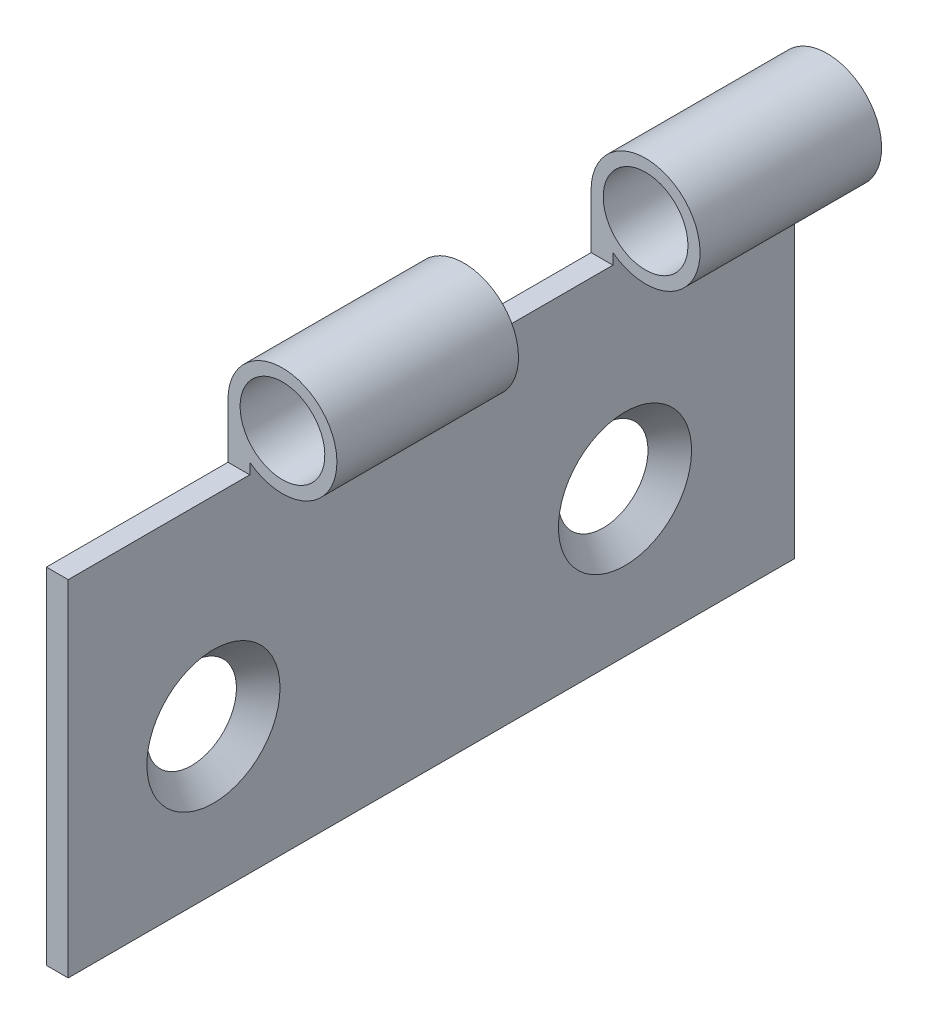
ISO-10303-21;
HEADER;
FILE_DESCRIPTION(('STEP AP214'),'2;1');
FILE_NAME('part.step','',(''),(''),'','','');
FILE_SCHEMA(('AUTOMOTIVE_DESIGN { 1 0 10303 214 1 1 1 1 }'));
ENDSEC;
DATA;
#1=APPLICATION_CONTEXT('core data for automotive mechanical design processes');
#2=APPLICATION_PROTOCOL_DEFINITION('international standard','automotive_design',2000,#1);
#3=PRODUCT_CONTEXT('',#1,'mechanical');
#4=PRODUCT('Part','Part','',(#3));
#5=PRODUCT_RELATED_PRODUCT_CATEGORY('part','',(#4));
#6=PRODUCT_DEFINITION_FORMATION('','',#4);
#7=PRODUCT_DEFINITION_CONTEXT('part definition',#1,'design');
#8=PRODUCT_DEFINITION('design','',#6,#7);
#9=PRODUCT_DEFINITION_SHAPE('','',#8);
#10=(LENGTH_UNIT() NAMED_UNIT(*) SI_UNIT(.MILLI.,.METRE.));
#11=(NAMED_UNIT(*) PLANE_ANGLE_UNIT() SI_UNIT($,.RADIAN.));
#12=(NAMED_UNIT(*) SI_UNIT($,.STERADIAN.) SOLID_ANGLE_UNIT());
#13=UNCERTAINTY_MEASURE_WITH_UNIT(LENGTH_MEASURE(1.E-05),#10,'distance_accuracy_value','');
#14=(GEOMETRIC_REPRESENTATION_CONTEXT(3) GLOBAL_UNCERTAINTY_ASSIGNED_CONTEXT((#13)) GLOBAL_UNIT_ASSIGNED_CONTEXT((#10,
#11,#12)) REPRESENTATION_CONTEXT('',''));
#15=CARTESIAN_POINT('',(0.,0.,0.));
#16=DIRECTION('',(0.,0.,1.));
#17=DIRECTION('',(1.,0.,0.));
#18=AXIS2_PLACEMENT_3D('',#15,#16,#17);
#19=CARTESIAN_POINT('',(0.,0.,15.));
#20=DIRECTION('',(-1.,0.,0.));
#21=DIRECTION('',(0.,0.,1.));
#22=AXIS2_PLACEMENT_3D('',#19,#20,#21);
#23=PLANE('',#22);
#24=CARTESIAN_POINT('',(0.,6.,9.));
#25=DIRECTION('',(-1.,0.,0.));
#26=DIRECTION('',(0.,0.,1.));
#27=AXIS2_PLACEMENT_3D('',#24,#25,#26);
#28=CIRCLE('',#27,1.85);
#29=CARTESIAN_POINT('',(0.,6.,10.85));
#30=VERTEX_POINT('',#29);
#31=EDGE_CURVE('E272',#30,#30,#28,.T.);
#32=ORIENTED_EDGE('',*,*,#31,.F.);
#33=EDGE_LOOP('',(#32));
#34=FACE_BOUND('',#33,.T.);
#35=CARTESIAN_POINT('',(0.,6.,-8.));
#36=DIRECTION('',(-1.,0.,0.));
#37=DIRECTION('',(0.,0.,1.));
#38=AXIS2_PLACEMENT_3D('',#35,#36,#37);
#39=CIRCLE('',#38,1.85);
#40=CARTESIAN_POINT('',(0.,6.,-6.15));
#41=VERTEX_POINT('',#40);
#42=EDGE_CURVE('E44',#41,#41,#39,.T.);
#43=ORIENTED_EDGE('',*,*,#42,.F.);
#44=EDGE_LOOP('',(#43));
#45=FACE_BOUND('',#44,.T.);
#46=DIRECTION('',(0.,1.,0.));
#47=VECTOR('',#46,1.);
#48=CARTESIAN_POINT('',(0.,18.75,0.));
#49=LINE('',#48,#47);
#50=CARTESIAN_POINT('',(0.,14.25,0.));
#51=VERTEX_POINT('',#50);
#52=CARTESIAN_POINT('',(0.,16.5,0.));
#53=VERTEX_POINT('',#52);
#54=EDGE_CURVE('E252',#51,#53,#49,.T.);
#55=ORIENTED_EDGE('',*,*,#54,.F.);
#56=DIRECTION('',(0.,0.,1.));
#57=VECTOR('',#56,1.);
#58=CARTESIAN_POINT('',(0.,14.25,0.));
#59=LINE('',#58,#57);
#60=CARTESIAN_POINT('',(0.,14.25,-7.5));
#61=VERTEX_POINT('',#60);
#62=EDGE_CURVE('E265',#61,#51,#59,.T.);
#63=ORIENTED_EDGE('',*,*,#62,.F.);
#64=DIRECTION('',(0.,-1.,0.));
#65=VECTOR('',#64,1.);
#66=CARTESIAN_POINT('',(0.,18.75,-7.5));
#67=LINE('',#66,#65);
#68=CARTESIAN_POINT('',(0.,16.5,-7.5));
#69=VERTEX_POINT('',#68);
#70=EDGE_CURVE('E262',#69,#61,#67,.T.);
#71=ORIENTED_EDGE('',*,*,#70,.F.);
#72=DIRECTION('',(0.,0.,-1.));
#73=VECTOR('',#72,1.);
#74=CARTESIAN_POINT('',(0.,16.5,15.));
#75=LINE('',#74,#73);
#76=CARTESIAN_POINT('',(0.,16.5,-15.));
#77=VERTEX_POINT('',#76);
#78=EDGE_CURVE('E51',#69,#77,#75,.T.);
#79=ORIENTED_EDGE('',*,*,#78,.T.);
#80=DIRECTION('',(0.,1.,0.));
#81=VECTOR('',#80,1.);
#82=CARTESIAN_POINT('',(0.,0.,-15.));
#83=LINE('',#82,#81);
#84=CARTESIAN_POINT('',(0.,0.,-15.));
#85=VERTEX_POINT('',#84);
#86=EDGE_CURVE('E102',#85,#77,#83,.T.);
#87=ORIENTED_EDGE('',*,*,#86,.F.);
#88=DIRECTION('',(0.,0.,-1.));
#89=VECTOR('',#88,1.);
#90=CARTESIAN_POINT('',(0.,0.,15.));
#91=LINE('',#90,#89);
#92=CARTESIAN_POINT('',(0.,0.,15.));
#93=VERTEX_POINT('',#92);
#94=EDGE_CURVE('E78',#93,#85,#91,.T.);
#95=ORIENTED_EDGE('',*,*,#94,.F.);
#96=DIRECTION('',(0.,1.,0.));
#97=VECTOR('',#96,1.);
#98=CARTESIAN_POINT('',(0.,0.,15.));
#99=LINE('',#98,#97);
#100=CARTESIAN_POINT('',(0.,14.25,15.));
#101=VERTEX_POINT('',#100);
#102=EDGE_CURVE('E110',#93,#101,#99,.T.);
#103=ORIENTED_EDGE('',*,*,#102,.T.);
#104=DIRECTION('',(0.,0.,1.));
#105=VECTOR('',#104,1.);
#106=CARTESIAN_POINT('',(0.,14.25,15.));
#107=LINE('',#106,#105);
#108=CARTESIAN_POINT('',(0.,14.25,7.5));
#109=VERTEX_POINT('',#108);
#110=EDGE_CURVE('E163',#109,#101,#107,.T.);
#111=ORIENTED_EDGE('',*,*,#110,.F.);
#112=DIRECTION('',(0.,-1.,0.));
#113=VECTOR('',#112,1.);
#114=CARTESIAN_POINT('',(0.,18.75,7.5));
#115=LINE('',#114,#113);
#116=CARTESIAN_POINT('',(0.,16.5,7.5));
#117=VERTEX_POINT('',#116);
#118=EDGE_CURVE('E159',#117,#109,#115,.T.);
#119=ORIENTED_EDGE('',*,*,#118,.F.);
#120=EDGE_CURVE('E11',#117,#53,#75,.T.);
#121=ORIENTED_EDGE('',*,*,#120,.T.);
#122=EDGE_LOOP('',(#55,#63,#71,#79,#87,#95,#103,#111,#119,#121));
#123=FACE_BOUND('',#122,.T.);
#124=ADVANCED_FACE('F40',(#34,#45,#123),#23,.T.);
#125=CARTESIAN_POINT('',(2.25,16.5,-15.));
#126=DIRECTION('',(0.,0.,1.));
#127=DIRECTION('',(1.,0.,0.));
#128=AXIS2_PLACEMENT_3D('',#125,#126,#127);
#129=CYLINDRICAL_SURFACE('',#128,2.25);
#130=CARTESIAN_POINT('',(2.25,16.5,0.));
#131=DIRECTION('',(0.,0.,1.));
#132=DIRECTION('',(0.,-1.,0.));
#133=AXIS2_PLACEMENT_3D('',#130,#131,#132);
#134=CIRCLE('',#133,2.25);
#135=CARTESIAN_POINT('',(0.9,14.7,0.));
#136=VERTEX_POINT('',#135);
#137=EDGE_CURVE('E131',#53,#136,#134,.F.);
#138=ORIENTED_EDGE('',*,*,#137,.F.);
#139=ORIENTED_EDGE('',*,*,#120,.F.);
#140=CARTESIAN_POINT('',(2.25,16.5,7.5));
#141=DIRECTION('',(0.,0.,-1.));
#142=DIRECTION('',(-1.,0.,0.));
#143=AXIS2_PLACEMENT_3D('',#140,#141,#142);
#144=CIRCLE('',#143,2.25);
#145=CARTESIAN_POINT('',(0.900000000000001,14.7,7.5));
#146=VERTEX_POINT('',#145);
#147=EDGE_CURVE('E121',#146,#117,#144,.F.);
#148=ORIENTED_EDGE('',*,*,#147,.F.);
#149=DIRECTION('',(0.,0.,1.));
#150=VECTOR('',#149,1.);
#151=CARTESIAN_POINT('',(0.9,14.7,-15.));
#152=LINE('',#151,#150);
#153=EDGE_CURVE('E187',#136,#146,#152,.T.);
#154=ORIENTED_EDGE('',*,*,#153,.F.);
#155=EDGE_LOOP('',(#138,#139,#148,#154));
#156=FACE_BOUND('',#155,.T.);
#157=ADVANCED_FACE('F257',(#156),#129,.T.);
#158=CARTESIAN_POINT('',(2.25,16.5,-15.));
#159=DIRECTION('',(0.,0.,1.));
#160=DIRECTION('',(1.,0.,0.));
#161=AXIS2_PLACEMENT_3D('',#158,#159,#160);
#162=CYLINDRICAL_SURFACE('',#161,1.75);
#163=CARTESIAN_POINT('',(2.25,16.5,0.));
#164=DIRECTION('',(0.,0.,1.));
#165=DIRECTION('',(0.,-1.,0.));
#166=AXIS2_PLACEMENT_3D('',#163,#164,#165);
#167=CIRCLE('',#166,1.75);
#168=CARTESIAN_POINT('',(2.25,14.75,0.));
#169=VERTEX_POINT('',#168);
#170=EDGE_CURVE('E128',#169,#169,#167,.F.);
#171=ORIENTED_EDGE('',*,*,#170,.T.);
#172=EDGE_LOOP('',(#171));
#173=FACE_BOUND('',#172,.T.);
#174=CARTESIAN_POINT('',(2.25,16.5,7.5));
#175=DIRECTION('',(0.,0.,-1.));
#176=DIRECTION('',(-1.,0.,0.));
#177=AXIS2_PLACEMENT_3D('',#174,#175,#176);
#178=CIRCLE('',#177,1.75);
#179=CARTESIAN_POINT('',(0.499999999999999,16.5,7.5));
#180=VERTEX_POINT('',#179);
#181=EDGE_CURVE('E117',#180,#180,#178,.F.);
#182=ORIENTED_EDGE('',*,*,#181,.T.);
#183=EDGE_LOOP('',(#182));
#184=FACE_BOUND('',#183,.T.);
#185=ADVANCED_FACE('F315',(#173,#184),#162,.F.);
#186=CARTESIAN_POINT('',(0.9,0.,15.));
#187=DIRECTION('',(-1.,0.,0.));
#188=DIRECTION('',(0.,0.,1.));
#189=AXIS2_PLACEMENT_3D('',#186,#187,#188);
#190=PLANE('',#189);
#191=CARTESIAN_POINT('',(0.9,6.,9.));
#192=DIRECTION('',(1.,0.,0.));
#193=DIRECTION('',(0.,0.,-1.));
#194=AXIS2_PLACEMENT_3D('',#191,#192,#193);
#195=CIRCLE('',#194,2.75);
#196=CARTESIAN_POINT('',(0.9,6.,6.25));
#197=VERTEX_POINT('',#196);
#198=EDGE_CURVE('E279',#197,#197,#195,.T.);
#199=ORIENTED_EDGE('',*,*,#198,.F.);
#200=EDGE_LOOP('',(#199));
#201=FACE_BOUND('',#200,.T.);
#202=CARTESIAN_POINT('',(0.9,6.,-8.));
#203=DIRECTION('',(1.,0.,0.));
#204=DIRECTION('',(0.,0.,-1.));
#205=AXIS2_PLACEMENT_3D('',#202,#203,#204);
#206=CIRCLE('',#205,2.75);
#207=CARTESIAN_POINT('',(0.9,6.,-10.75));
#208=VERTEX_POINT('',#207);
#209=EDGE_CURVE('E270',#208,#208,#206,.T.);
#210=ORIENTED_EDGE('',*,*,#209,.F.);
#211=EDGE_LOOP('',(#210));
#212=FACE_BOUND('',#211,.T.);
#213=DIRECTION('',(0.,0.,1.));
#214=VECTOR('',#213,1.);
#215=CARTESIAN_POINT('',(0.9,14.25,15.));
#216=LINE('',#215,#214);
#217=CARTESIAN_POINT('',(0.9,14.25,-7.5));
#218=VERTEX_POINT('',#217);
#219=CARTESIAN_POINT('',(0.9,14.25,0.));
#220=VERTEX_POINT('',#219);
#221=EDGE_CURVE('E156',#218,#220,#216,.T.);
#222=ORIENTED_EDGE('',*,*,#221,.T.);
#223=DIRECTION('',(0.,1.,0.));
#224=VECTOR('',#223,1.);
#225=CARTESIAN_POINT('',(0.9,0.,0.));
#226=LINE('',#225,#224);
#227=EDGE_CURVE('E139',#220,#136,#226,.T.);
#228=ORIENTED_EDGE('',*,*,#227,.T.);
#229=ORIENTED_EDGE('',*,*,#153,.T.);
#230=DIRECTION('',(0.,-1.,0.));
#231=VECTOR('',#230,1.);
#232=CARTESIAN_POINT('',(0.9,0.,7.5));
#233=LINE('',#232,#231);
#234=CARTESIAN_POINT('',(0.9,14.25,7.5));
#235=VERTEX_POINT('',#234);
#236=EDGE_CURVE('E176',#146,#235,#233,.T.);
#237=ORIENTED_EDGE('',*,*,#236,.T.);
#238=DIRECTION('',(0.,0.,1.));
#239=VECTOR('',#238,1.);
#240=CARTESIAN_POINT('',(0.9,14.25,15.));
#241=LINE('',#240,#239);
#242=CARTESIAN_POINT('',(0.9,14.25,15.));
#243=VERTEX_POINT('',#242);
#244=EDGE_CURVE('E179',#235,#243,#241,.T.);
#245=ORIENTED_EDGE('',*,*,#244,.T.);
#246=DIRECTION('',(0.,1.,0.));
#247=VECTOR('',#246,1.);
#248=CARTESIAN_POINT('',(0.9,0.,15.));
#249=LINE('',#248,#247);
#250=CARTESIAN_POINT('',(0.9,0.,15.));
#251=VERTEX_POINT('',#250);
#252=EDGE_CURVE('E88',#251,#243,#249,.T.);
#253=ORIENTED_EDGE('',*,*,#252,.F.);
#254=DIRECTION('',(0.,0.,-1.));
#255=VECTOR('',#254,1.);
#256=CARTESIAN_POINT('',(0.9,0.,15.));
#257=LINE('',#256,#255);
#258=CARTESIAN_POINT('',(0.9,0.,-15.));
#259=VERTEX_POINT('',#258);
#260=EDGE_CURVE('E63',#251,#259,#257,.T.);
#261=ORIENTED_EDGE('',*,*,#260,.T.);
#262=DIRECTION('',(0.,1.,0.));
#263=VECTOR('',#262,1.);
#264=CARTESIAN_POINT('',(0.9,0.,-15.));
#265=LINE('',#264,#263);
#266=CARTESIAN_POINT('',(0.9,14.7,-15.));
#267=VERTEX_POINT('',#266);
#268=EDGE_CURVE('E85',#259,#267,#265,.T.);
#269=ORIENTED_EDGE('',*,*,#268,.T.);
#270=CARTESIAN_POINT('',(0.9,14.7,-7.5));
#271=VERTEX_POINT('',#270);
#272=EDGE_CURVE('E103',#267,#271,#152,.T.);
#273=ORIENTED_EDGE('',*,*,#272,.T.);
#274=DIRECTION('',(0.,-1.,0.));
#275=VECTOR('',#274,1.);
#276=CARTESIAN_POINT('',(0.9,0.,-7.5));
#277=LINE('',#276,#275);
#278=EDGE_CURVE('E132',#271,#218,#277,.T.);
#279=ORIENTED_EDGE('',*,*,#278,.T.);
#280=EDGE_LOOP('',(#222,#228,#229,#237,#245,#253,#261,#269,#273,#279));
#281=FACE_BOUND('',#280,.T.);
#282=ADVANCED_FACE('F42',(#201,#212,#281),#190,.F.);
#283=CARTESIAN_POINT('',(0.9,0.,15.));
#284=DIRECTION('',(0.,-1.,0.));
#285=DIRECTION('',(0.,0.,-1.));
#286=AXIS2_PLACEMENT_3D('',#283,#284,#285);
#287=PLANE('',#286);
#288=DIRECTION('',(-1.,0.,0.));
#289=VECTOR('',#288,1.);
#290=CARTESIAN_POINT('',(0.9,0.,-15.));
#291=LINE('',#290,#289);
#292=EDGE_CURVE('E98',#259,#85,#291,.T.);
#293=ORIENTED_EDGE('',*,*,#292,.F.);
#294=ORIENTED_EDGE('',*,*,#260,.F.);
#295=DIRECTION('',(-1.,0.,0.));
#296=VECTOR('',#295,1.);
#297=CARTESIAN_POINT('',(0.9,0.,15.));
#298=LINE('',#297,#296);
#299=EDGE_CURVE('E91',#251,#93,#298,.T.);
#300=ORIENTED_EDGE('',*,*,#299,.T.);
#301=ORIENTED_EDGE('',*,*,#94,.T.);
#302=EDGE_LOOP('',(#293,#294,#300,#301));
#303=FACE_BOUND('',#302,.T.);
#304=ADVANCED_FACE('F105',(#303),#287,.T.);
#305=CARTESIAN_POINT('',(0.,0.,15.));
#306=DIRECTION('',(0.,0.,-1.));
#307=DIRECTION('',(-1.,0.,0.));
#308=AXIS2_PLACEMENT_3D('',#305,#306,#307);
#309=PLANE('',#308);
#310=ORIENTED_EDGE('',*,*,#252,.T.);
#311=DIRECTION('',(-1.,0.,0.));
#312=VECTOR('',#311,1.);
#313=CARTESIAN_POINT('',(10.,14.25,15.));
#314=LINE('',#313,#312);
#315=EDGE_CURVE('E122',#243,#101,#314,.T.);
#316=ORIENTED_EDGE('',*,*,#315,.T.);
#317=ORIENTED_EDGE('',*,*,#102,.F.);
#318=ORIENTED_EDGE('',*,*,#299,.F.);
#319=EDGE_LOOP('',(#310,#316,#317,#318));
#320=FACE_BOUND('',#319,.T.);
#321=ADVANCED_FACE('F195',(#320),#309,.F.);
#322=CARTESIAN_POINT('',(0.,0.,-15.));
#323=DIRECTION('',(0.,0.,-1.));
#324=DIRECTION('',(-1.,0.,0.));
#325=AXIS2_PLACEMENT_3D('',#322,#323,#324);
#326=PLANE('',#325);
#327=CARTESIAN_POINT('',(2.25,16.5,-15.));
#328=DIRECTION('',(0.,0.,1.));
#329=DIRECTION('',(1.,0.,0.));
#330=AXIS2_PLACEMENT_3D('',#327,#328,#329);
#331=CIRCLE('',#330,1.75);
#332=CARTESIAN_POINT('',(4.,16.5,-15.));
#333=VERTEX_POINT('',#332);
#334=EDGE_CURVE('E182',#333,#333,#331,.T.);
#335=ORIENTED_EDGE('',*,*,#334,.T.);
#336=EDGE_LOOP('',(#335));
#337=FACE_BOUND('',#336,.T.);
#338=ORIENTED_EDGE('',*,*,#86,.T.);
#339=CARTESIAN_POINT('',(2.25,16.5,-15.));
#340=DIRECTION('',(0.,0.,1.));
#341=DIRECTION('',(1.,0.,0.));
#342=AXIS2_PLACEMENT_3D('',#339,#340,#341);
#343=CIRCLE('',#342,2.25);
#344=EDGE_CURVE('E100',#267,#77,#343,.T.);
#345=ORIENTED_EDGE('',*,*,#344,.F.);
#346=ORIENTED_EDGE('',*,*,#268,.F.);
#347=ORIENTED_EDGE('',*,*,#292,.T.);
#348=EDGE_LOOP('',(#338,#345,#346,#347));
#349=FACE_BOUND('',#348,.T.);
#350=ADVANCED_FACE('F97',(#337,#349),#326,.T.);
#351=CARTESIAN_POINT('',(2.25,16.5,-7.5));
#352=DIRECTION('',(0.,0.,-1.));
#353=DIRECTION('',(0.,1.,0.));
#354=AXIS2_PLACEMENT_3D('',#351,#352,#353);
#355=CIRCLE('',#354,2.25);
#356=EDGE_CURVE('E126',#271,#69,#355,.F.);
#357=ORIENTED_EDGE('',*,*,#356,.F.);
#358=ORIENTED_EDGE('',*,*,#272,.F.);
#359=ORIENTED_EDGE('',*,*,#344,.T.);
#360=ORIENTED_EDGE('',*,*,#78,.F.);
#361=EDGE_LOOP('',(#357,#358,#359,#360));
#362=FACE_BOUND('',#361,.T.);
#363=ADVANCED_FACE('F226',(#362),#129,.T.);
#364=CARTESIAN_POINT('',(2.25,16.5,-7.5));
#365=DIRECTION('',(0.,0.,-1.));
#366=DIRECTION('',(0.,1.,0.));
#367=AXIS2_PLACEMENT_3D('',#364,#365,#366);
#368=CIRCLE('',#367,1.75);
#369=CARTESIAN_POINT('',(2.25,18.25,-7.5));
#370=VERTEX_POINT('',#369);
#371=EDGE_CURVE('E123',#370,#370,#368,.F.);
#372=ORIENTED_EDGE('',*,*,#371,.T.);
#373=EDGE_LOOP('',(#372));
#374=FACE_BOUND('',#373,.T.);
#375=ORIENTED_EDGE('',*,*,#334,.F.);
#376=EDGE_LOOP('',(#375));
#377=FACE_BOUND('',#376,.T.);
#378=ADVANCED_FACE('F305',(#374,#377),#162,.F.);
#379=CARTESIAN_POINT('',(10.,14.25,15.));
#380=DIRECTION('',(0.,-1.,0.));
#381=DIRECTION('',(0.,0.,-1.));
#382=AXIS2_PLACEMENT_3D('',#379,#380,#381);
#383=PLANE('',#382);
#384=DIRECTION('',(-1.,0.,0.));
#385=VECTOR('',#384,1.);
#386=CARTESIAN_POINT('',(10.,14.25,7.5));
#387=LINE('',#386,#385);
#388=EDGE_CURVE('E166',#235,#109,#387,.T.);
#389=ORIENTED_EDGE('',*,*,#388,.T.);
#390=ORIENTED_EDGE('',*,*,#110,.T.);
#391=ORIENTED_EDGE('',*,*,#315,.F.);
#392=ORIENTED_EDGE('',*,*,#244,.F.);
#393=EDGE_LOOP('',(#389,#390,#391,#392));
#394=FACE_BOUND('',#393,.T.);
#395=ADVANCED_FACE('F303',(#394),#383,.F.);
#396=CARTESIAN_POINT('',(10.,18.75,7.5));
#397=DIRECTION('',(0.,0.,-1.));
#398=DIRECTION('',(-1.,0.,0.));
#399=AXIS2_PLACEMENT_3D('',#396,#397,#398);
#400=PLANE('',#399);
#401=ORIENTED_EDGE('',*,*,#181,.F.);
#402=EDGE_LOOP('',(#401));
#403=FACE_BOUND('',#402,.T.);
#404=ORIENTED_EDGE('',*,*,#236,.F.);
#405=ORIENTED_EDGE('',*,*,#147,.T.);
#406=ORIENTED_EDGE('',*,*,#118,.T.);
#407=ORIENTED_EDGE('',*,*,#388,.F.);
#408=EDGE_LOOP('',(#404,#405,#406,#407));
#409=FACE_BOUND('',#408,.T.);
#410=ADVANCED_FACE('F302',(#403,#409),#400,.F.);
#411=CARTESIAN_POINT('',(10.,14.25,0.));
#412=DIRECTION('',(0.,-1.,0.));
#413=DIRECTION('',(0.,0.,-1.));
#414=AXIS2_PLACEMENT_3D('',#411,#412,#413);
#415=PLANE('',#414);
#416=DIRECTION('',(-1.,0.,0.));
#417=VECTOR('',#416,1.);
#418=CARTESIAN_POINT('',(10.,14.25,-7.5));
#419=LINE('',#418,#417);
#420=EDGE_CURVE('E268',#218,#61,#419,.T.);
#421=ORIENTED_EDGE('',*,*,#420,.T.);
#422=ORIENTED_EDGE('',*,*,#62,.T.);
#423=DIRECTION('',(-1.,0.,0.));
#424=VECTOR('',#423,1.);
#425=CARTESIAN_POINT('',(10.,14.25,0.));
#426=LINE('',#425,#424);
#427=EDGE_CURVE('E127',#220,#51,#426,.T.);
#428=ORIENTED_EDGE('',*,*,#427,.F.);
#429=ORIENTED_EDGE('',*,*,#221,.F.);
#430=EDGE_LOOP('',(#421,#422,#428,#429));
#431=FACE_BOUND('',#430,.T.);
#432=ADVANCED_FACE('F291',(#431),#415,.F.);
#433=CARTESIAN_POINT('',(10.,18.75,0.));
#434=DIRECTION('',(0.,0.,1.));
#435=DIRECTION('',(0.,-1.,0.));
#436=AXIS2_PLACEMENT_3D('',#433,#434,#435);
#437=PLANE('',#436);
#438=ORIENTED_EDGE('',*,*,#170,.F.);
#439=EDGE_LOOP('',(#438));
#440=FACE_BOUND('',#439,.T.);
#441=ORIENTED_EDGE('',*,*,#427,.T.);
#442=ORIENTED_EDGE('',*,*,#54,.T.);
#443=ORIENTED_EDGE('',*,*,#137,.T.);
#444=ORIENTED_EDGE('',*,*,#227,.F.);
#445=EDGE_LOOP('',(#441,#442,#443,#444));
#446=FACE_BOUND('',#445,.T.);
#447=ADVANCED_FACE('F250',(#440,#446),#437,.F.);
#448=CARTESIAN_POINT('',(10.,18.75,-7.5));
#449=DIRECTION('',(0.,0.,-1.));
#450=DIRECTION('',(0.,1.,0.));
#451=AXIS2_PLACEMENT_3D('',#448,#449,#450);
#452=PLANE('',#451);
#453=ORIENTED_EDGE('',*,*,#371,.F.);
#454=EDGE_LOOP('',(#453));
#455=FACE_BOUND('',#454,.T.);
#456=ORIENTED_EDGE('',*,*,#278,.F.);
#457=ORIENTED_EDGE('',*,*,#356,.T.);
#458=ORIENTED_EDGE('',*,*,#70,.T.);
#459=ORIENTED_EDGE('',*,*,#420,.F.);
#460=EDGE_LOOP('',(#456,#457,#458,#459));
#461=FACE_BOUND('',#460,.T.);
#462=ADVANCED_FACE('F297',(#455,#461),#452,.F.);
#463=CARTESIAN_POINT('',(0.9,6.,-8.));
#464=DIRECTION('',(1.,0.,0.));
#465=DIRECTION('',(0.,0.,-1.));
#466=AXIS2_PLACEMENT_3D('',#463,#464,#465);
#467=CONICAL_SURFACE('',#466,2.75,0.785398163397448);
#468=ORIENTED_EDGE('',*,*,#42,.T.);
#469=EDGE_LOOP('',(#468));
#470=FACE_BOUND('',#469,.T.);
#471=ORIENTED_EDGE('',*,*,#209,.T.);
#472=EDGE_LOOP('',(#471));
#473=FACE_BOUND('',#472,.T.);
#474=ADVANCED_FACE('F379',(#470,#473),#467,.F.);
#475=CARTESIAN_POINT('',(0.9,6.,9.));
#476=DIRECTION('',(1.,0.,0.));
#477=DIRECTION('',(0.,0.,-1.));
#478=AXIS2_PLACEMENT_3D('',#475,#476,#477);
#479=CONICAL_SURFACE('',#478,2.75,0.785398163397448);
#480=ORIENTED_EDGE('',*,*,#31,.T.);
#481=EDGE_LOOP('',(#480));
#482=FACE_BOUND('',#481,.T.);
#483=ORIENTED_EDGE('',*,*,#198,.T.);
#484=EDGE_LOOP('',(#483));
#485=FACE_BOUND('',#484,.T.);
#486=ADVANCED_FACE('F405',(#482,#485),#479,.F.);
#487=CLOSED_SHELL('',(#124,#157,#185,#282,#304,#321,#350,#363,#378,#395,#410,#432,#447,#462,
#474,#486));
#488=MANIFOLD_SOLID_BREP('B2',#487);
#489=ADVANCED_BREP_SHAPE_REPRESENTATION('',(#18,#488),#14);
#490=SHAPE_DEFINITION_REPRESENTATION(#9,#489);
ENDSEC;
END-ISO-10303-21;
